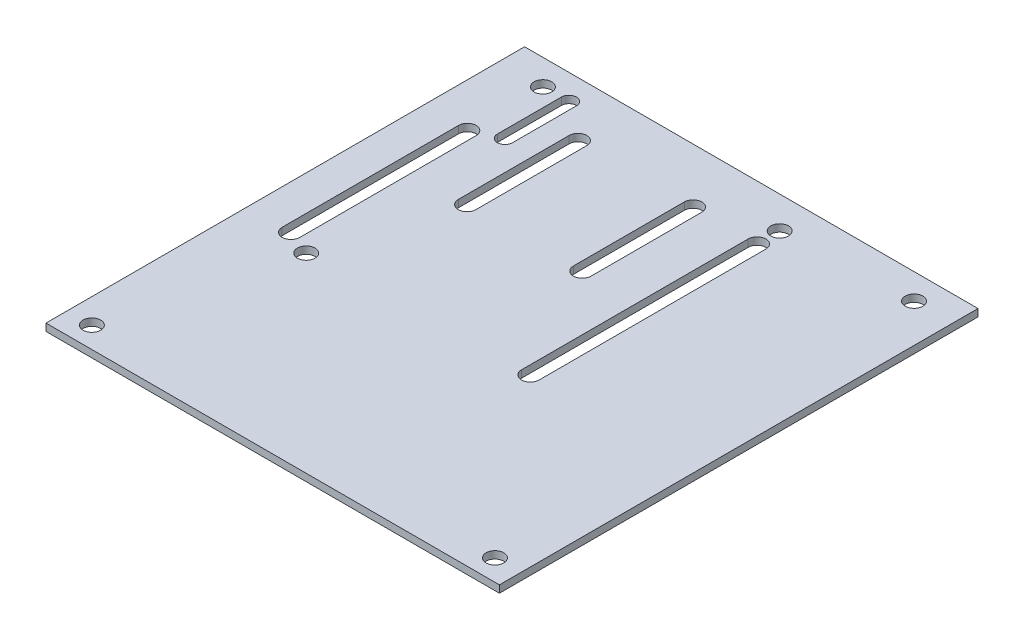
ISO-10303-21;
HEADER;
FILE_DESCRIPTION(('STEP AP214'),'2;1');
FILE_NAME('part.step','',(''),(''),'','','');
FILE_SCHEMA(('AUTOMOTIVE_DESIGN { 1 0 10303 214 1 1 1 1 }'));
ENDSEC;
DATA;
#1=APPLICATION_CONTEXT('core data for automotive mechanical design processes');
#2=APPLICATION_PROTOCOL_DEFINITION('international standard','automotive_design',2000,#1);
#3=PRODUCT_CONTEXT('',#1,'mechanical');
#4=PRODUCT('Part','Part','',(#3));
#5=PRODUCT_RELATED_PRODUCT_CATEGORY('part','',(#4));
#6=PRODUCT_DEFINITION_FORMATION('','',#4);
#7=PRODUCT_DEFINITION_CONTEXT('part definition',#1,'design');
#8=PRODUCT_DEFINITION('design','',#6,#7);
#9=PRODUCT_DEFINITION_SHAPE('','',#8);
#10=(LENGTH_UNIT() NAMED_UNIT(*) SI_UNIT(.MILLI.,.METRE.));
#11=(NAMED_UNIT(*) PLANE_ANGLE_UNIT() SI_UNIT($,.RADIAN.));
#12=(NAMED_UNIT(*) SI_UNIT($,.STERADIAN.) SOLID_ANGLE_UNIT());
#13=UNCERTAINTY_MEASURE_WITH_UNIT(LENGTH_MEASURE(1.E-05),#10,'distance_accuracy_value','');
#14=(GEOMETRIC_REPRESENTATION_CONTEXT(3) GLOBAL_UNCERTAINTY_ASSIGNED_CONTEXT((#13)) GLOBAL_UNIT_ASSIGNED_CONTEXT((#10,
#11,#12)) REPRESENTATION_CONTEXT('',''));
#15=CARTESIAN_POINT('',(0.,0.,0.));
#16=DIRECTION('',(0.,0.,1.));
#17=DIRECTION('',(1.,0.,0.));
#18=AXIS2_PLACEMENT_3D('',#15,#16,#17);
#19=CARTESIAN_POINT('',(0.,1.45,0.));
#20=DIRECTION('',(0.,1.,0.));
#21=DIRECTION('',(0.,0.,1.));
#22=AXIS2_PLACEMENT_3D('',#19,#20,#21);
#23=PLANE('',#22);
#24=CARTESIAN_POINT('',(39.92,1.45,43.305));
#25=DIRECTION('',(0.,-1.,0.));
#26=DIRECTION('',(0.,0.,-1.));
#27=AXIS2_PLACEMENT_3D('',#24,#25,#26);
#28=CIRCLE('',#27,1.75);
#29=CARTESIAN_POINT('',(39.92,1.45,41.555));
#30=VERTEX_POINT('',#29);
#31=EDGE_CURVE('E240',#30,#30,#28,.T.);
#32=ORIENTED_EDGE('',*,*,#31,.T.);
#33=EDGE_LOOP('',(#32));
#34=FACE_BOUND('',#33,.T.);
#35=CARTESIAN_POINT('',(-40.09,1.45,43.305));
#36=DIRECTION('',(0.,-1.,0.));
#37=DIRECTION('',(0.,0.,-1.));
#38=AXIS2_PLACEMENT_3D('',#35,#36,#37);
#39=CIRCLE('',#38,1.75);
#40=CARTESIAN_POINT('',(-40.09,1.45,41.555));
#41=VERTEX_POINT('',#40);
#42=EDGE_CURVE('E244',#41,#41,#39,.T.);
#43=ORIENTED_EDGE('',*,*,#42,.T.);
#44=EDGE_LOOP('',(#43));
#45=FACE_BOUND('',#44,.T.);
#46=CARTESIAN_POINT('',(37.38,1.45,-42.42));
#47=DIRECTION('',(0.,-1.,0.));
#48=DIRECTION('',(0.,0.,-1.));
#49=AXIS2_PLACEMENT_3D('',#46,#47,#48);
#50=CIRCLE('',#49,1.75);
#51=CARTESIAN_POINT('',(37.38,1.45,-44.17));
#52=VERTEX_POINT('',#51);
#53=EDGE_CURVE('E247',#52,#52,#50,.T.);
#54=ORIENTED_EDGE('',*,*,#53,.T.);
#55=EDGE_LOOP('',(#54));
#56=FACE_BOUND('',#55,.T.);
#57=CARTESIAN_POINT('',(-36.28,1.45,-42.42));
#58=DIRECTION('',(0.,-1.,0.));
#59=DIRECTION('',(0.,0.,-1.));
#60=AXIS2_PLACEMENT_3D('',#57,#58,#59);
#61=CIRCLE('',#60,1.75);
#62=CARTESIAN_POINT('',(-36.28,1.45,-44.17));
#63=VERTEX_POINT('',#62);
#64=EDGE_CURVE('E250',#63,#63,#61,.T.);
#65=ORIENTED_EDGE('',*,*,#64,.T.);
#66=EDGE_LOOP('',(#65));
#67=FACE_BOUND('',#66,.T.);
#68=CARTESIAN_POINT('',(-31.2,1.45,9.65));
#69=DIRECTION('',(0.,-1.,0.));
#70=DIRECTION('',(0.,0.,-1.));
#71=AXIS2_PLACEMENT_3D('',#68,#69,#70);
#72=CIRCLE('',#71,1.75);
#73=CARTESIAN_POINT('',(-31.2,1.45,7.9));
#74=VERTEX_POINT('',#73);
#75=EDGE_CURVE('E253',#74,#74,#72,.T.);
#76=ORIENTED_EDGE('',*,*,#75,.T.);
#77=EDGE_LOOP('',(#76));
#78=FACE_BOUND('',#77,.T.);
#79=CARTESIAN_POINT('',(11.98,1.45,-41.15));
#80=DIRECTION('',(0.,-1.,0.));
#81=DIRECTION('',(0.,0.,-1.));
#82=AXIS2_PLACEMENT_3D('',#79,#80,#81);
#83=CIRCLE('',#82,1.75);
#84=CARTESIAN_POINT('',(11.98,1.45,-42.9));
#85=VERTEX_POINT('',#84);
#86=EDGE_CURVE('E256',#85,#85,#83,.T.);
#87=ORIENTED_EDGE('',*,*,#86,.T.);
#88=EDGE_LOOP('',(#87));
#89=FACE_BOUND('',#88,.T.);
#90=DIRECTION('',(0.,0.,1.));
#91=VECTOR('',#90,1.);
#92=CARTESIAN_POINT('',(-32.7,1.45,-29.8));
#93=LINE('',#92,#91);
#94=CARTESIAN_POINT('',(-32.7,1.45,-29.8));
#95=VERTEX_POINT('',#94);
#96=CARTESIAN_POINT('',(-32.7,1.45,-42.5));
#97=VERTEX_POINT('',#96);
#98=EDGE_CURVE('E320',#95,#97,#93,.F.);
#99=ORIENTED_EDGE('',*,*,#98,.T.);
#100=CARTESIAN_POINT('',(-31.2,1.45,-42.5));
#101=DIRECTION('',(0.,-1.,0.));
#102=DIRECTION('',(0.,0.,-1.));
#103=AXIS2_PLACEMENT_3D('',#100,#101,#102);
#104=CIRCLE('',#103,1.5);
#105=CARTESIAN_POINT('',(-29.7,1.45,-42.5));
#106=VERTEX_POINT('',#105);
#107=EDGE_CURVE('E260',#97,#106,#104,.T.);
#108=ORIENTED_EDGE('',*,*,#107,.T.);
#109=DIRECTION('',(0.,0.,-1.));
#110=VECTOR('',#109,1.);
#111=CARTESIAN_POINT('',(-29.7,1.45,-42.5));
#112=LINE('',#111,#110);
#113=CARTESIAN_POINT('',(-29.7,1.45,-29.8));
#114=VERTEX_POINT('',#113);
#115=EDGE_CURVE('E317',#106,#114,#112,.F.);
#116=ORIENTED_EDGE('',*,*,#115,.T.);
#117=CARTESIAN_POINT('',(-31.2,1.45,-29.8));
#118=DIRECTION('',(0.,-1.,0.));
#119=DIRECTION('',(0.,0.,-1.));
#120=AXIS2_PLACEMENT_3D('',#117,#118,#119);
#121=CIRCLE('',#120,1.5);
#122=EDGE_CURVE('E263',#114,#95,#121,.T.);
#123=ORIENTED_EDGE('',*,*,#122,.T.);
#124=EDGE_LOOP('',(#99,#108,#116,#123));
#125=FACE_BOUND('',#124,.T.);
#126=DIRECTION('',(0.,0.,1.));
#127=VECTOR('',#126,1.);
#128=CARTESIAN_POINT('',(10.23,1.45,8.34999999999999));
#129=LINE('',#128,#127);
#130=CARTESIAN_POINT('',(10.23,1.45,8.34999999999999));
#131=VERTEX_POINT('',#130);
#132=CARTESIAN_POINT('',(10.23,1.45,-36.65));
#133=VERTEX_POINT('',#132);
#134=EDGE_CURVE('E325',#131,#133,#129,.F.);
#135=ORIENTED_EDGE('',*,*,#134,.T.);
#136=CARTESIAN_POINT('',(11.98,1.45,-36.65));
#137=DIRECTION('',(0.,-1.,0.));
#138=DIRECTION('',(0.,0.,-1.));
#139=AXIS2_PLACEMENT_3D('',#136,#137,#138);
#140=CIRCLE('',#139,1.75);
#141=CARTESIAN_POINT('',(13.73,1.45,-36.65));
#142=VERTEX_POINT('',#141);
#143=EDGE_CURVE('E267',#133,#142,#140,.T.);
#144=ORIENTED_EDGE('',*,*,#143,.T.);
#145=DIRECTION('',(0.,0.,-1.));
#146=VECTOR('',#145,1.);
#147=CARTESIAN_POINT('',(13.73,1.45,-36.65));
#148=LINE('',#147,#146);
#149=CARTESIAN_POINT('',(13.73,1.45,8.34999999999999));
#150=VERTEX_POINT('',#149);
#151=EDGE_CURVE('E322',#142,#150,#148,.F.);
#152=ORIENTED_EDGE('',*,*,#151,.T.);
#153=CARTESIAN_POINT('',(11.98,1.45,8.34999999999999));
#154=DIRECTION('',(0.,-1.,0.));
#155=DIRECTION('',(0.,0.,-1.));
#156=AXIS2_PLACEMENT_3D('',#153,#154,#155);
#157=CIRCLE('',#156,1.75);
#158=EDGE_CURVE('E271',#150,#131,#157,.T.);
#159=ORIENTED_EDGE('',*,*,#158,.T.);
#160=EDGE_LOOP('',(#135,#144,#152,#159));
#161=FACE_BOUND('',#160,.T.);
#162=DIRECTION('',(0.,0.,1.));
#163=VECTOR('',#162,1.);
#164=CARTESIAN_POINT('',(-38.03,1.45,7.57999999999999));
#165=LINE('',#164,#163);
#166=CARTESIAN_POINT('',(-38.03,1.45,7.57999999999999));
#167=VERTEX_POINT('',#166);
#168=CARTESIAN_POINT('',(-38.03,1.45,-27.42));
#169=VERTEX_POINT('',#168);
#170=EDGE_CURVE('E330',#167,#169,#165,.F.);
#171=ORIENTED_EDGE('',*,*,#170,.T.);
#172=CARTESIAN_POINT('',(-36.28,1.45,-27.42));
#173=DIRECTION('',(0.,-1.,0.));
#174=DIRECTION('',(0.,0.,-1.));
#175=AXIS2_PLACEMENT_3D('',#172,#173,#174);
#176=CIRCLE('',#175,1.75);
#177=CARTESIAN_POINT('',(-34.53,1.45,-27.42));
#178=VERTEX_POINT('',#177);
#179=EDGE_CURVE('E275',#169,#178,#176,.T.);
#180=ORIENTED_EDGE('',*,*,#179,.T.);
#181=DIRECTION('',(0.,0.,-1.));
#182=VECTOR('',#181,1.);
#183=CARTESIAN_POINT('',(-34.53,1.45,-27.42));
#184=LINE('',#183,#182);
#185=CARTESIAN_POINT('',(-34.53,1.45,7.57999999999999));
#186=VERTEX_POINT('',#185);
#187=EDGE_CURVE('E327',#178,#186,#184,.F.);
#188=ORIENTED_EDGE('',*,*,#187,.T.);
#189=CARTESIAN_POINT('',(-36.28,1.45,7.57999999999999));
#190=DIRECTION('',(0.,-1.,0.));
#191=DIRECTION('',(0.,0.,-1.));
#192=AXIS2_PLACEMENT_3D('',#189,#190,#191);
#193=CIRCLE('',#192,1.75);
#194=EDGE_CURVE('E279',#186,#167,#193,.T.);
#195=ORIENTED_EDGE('',*,*,#194,.T.);
#196=EDGE_LOOP('',(#171,#180,#188,#195));
#197=FACE_BOUND('',#196,.T.);
#198=DIRECTION('',(0.,0.,1.));
#199=VECTOR('',#198,1.);
#200=CARTESIAN_POINT('',(-2.47000000000001,1.45,-14.67));
#201=LINE('',#200,#199);
#202=CARTESIAN_POINT('',(-2.47000000000001,1.45,-14.67));
#203=VERTEX_POINT('',#202);
#204=CARTESIAN_POINT('',(-2.47000000000002,1.45,-36.67));
#205=VERTEX_POINT('',#204);
#206=EDGE_CURVE('E182',#203,#205,#201,.F.);
#207=ORIENTED_EDGE('',*,*,#206,.T.);
#208=CARTESIAN_POINT('',(-0.720000000000017,1.45,-36.67));
#209=DIRECTION('',(0.,-1.,0.));
#210=DIRECTION('',(0.,0.,-1.));
#211=AXIS2_PLACEMENT_3D('',#208,#209,#210);
#212=CIRCLE('',#211,1.75);
#213=CARTESIAN_POINT('',(1.02999999999999,1.45,-36.67));
#214=VERTEX_POINT('',#213);
#215=EDGE_CURVE('E283',#205,#214,#212,.T.);
#216=ORIENTED_EDGE('',*,*,#215,.T.);
#217=DIRECTION('',(0.,0.,-1.));
#218=VECTOR('',#217,1.);
#219=CARTESIAN_POINT('',(1.02999999999999,1.45,-36.67));
#220=LINE('',#219,#218);
#221=CARTESIAN_POINT('',(1.03,1.45,-14.67));
#222=VERTEX_POINT('',#221);
#223=EDGE_CURVE('E331',#214,#222,#220,.F.);
#224=ORIENTED_EDGE('',*,*,#223,.T.);
#225=CARTESIAN_POINT('',(-0.720000000000005,1.45,-14.67));
#226=DIRECTION('',(0.,-1.,0.));
#227=DIRECTION('',(0.,0.,-1.));
#228=AXIS2_PLACEMENT_3D('',#225,#226,#227);
#229=CIRCLE('',#228,1.75);
#230=EDGE_CURVE('E172',#222,#203,#229,.T.);
#231=ORIENTED_EDGE('',*,*,#230,.T.);
#232=EDGE_LOOP('',(#207,#216,#224,#231));
#233=FACE_BOUND('',#232,.T.);
#234=DIRECTION('',(0.,0.,1.));
#235=VECTOR('',#234,1.);
#236=CARTESIAN_POINT('',(-25.33,1.45,-14.67));
#237=LINE('',#236,#235);
#238=CARTESIAN_POINT('',(-25.33,1.45,-14.67));
#239=VERTEX_POINT('',#238);
#240=CARTESIAN_POINT('',(-25.33,1.45,-36.67));
#241=VERTEX_POINT('',#240);
#242=EDGE_CURVE('E184',#239,#241,#237,.F.);
#243=ORIENTED_EDGE('',*,*,#242,.T.);
#244=CARTESIAN_POINT('',(-23.58,1.45,-36.67));
#245=DIRECTION('',(0.,-1.,0.));
#246=DIRECTION('',(0.,0.,-1.));
#247=AXIS2_PLACEMENT_3D('',#244,#245,#246);
#248=CIRCLE('',#247,1.75);
#249=CARTESIAN_POINT('',(-21.83,1.45,-36.67));
#250=VERTEX_POINT('',#249);
#251=EDGE_CURVE('E176',#241,#250,#248,.T.);
#252=ORIENTED_EDGE('',*,*,#251,.T.);
#253=DIRECTION('',(0.,0.,-1.));
#254=VECTOR('',#253,1.);
#255=CARTESIAN_POINT('',(-21.83,1.45,-36.67));
#256=LINE('',#255,#254);
#257=CARTESIAN_POINT('',(-21.83,1.45,-14.67));
#258=VERTEX_POINT('',#257);
#259=EDGE_CURVE('E168',#250,#258,#256,.F.);
#260=ORIENTED_EDGE('',*,*,#259,.T.);
#261=CARTESIAN_POINT('',(-23.58,1.45,-14.67));
#262=DIRECTION('',(0.,-1.,0.));
#263=DIRECTION('',(0.,0.,-1.));
#264=AXIS2_PLACEMENT_3D('',#261,#262,#263);
#265=CIRCLE('',#264,1.75);
#266=EDGE_CURVE('E19',#258,#239,#265,.T.);
#267=ORIENTED_EDGE('',*,*,#266,.T.);
#268=EDGE_LOOP('',(#243,#252,#260,#267));
#269=FACE_BOUND('',#268,.T.);
#270=DIRECTION('',(0.,0.,1.));
#271=VECTOR('',#270,1.);
#272=CARTESIAN_POINT('',(-45.,1.45,-47.5));
#273=LINE('',#272,#271);
#274=CARTESIAN_POINT('',(-45.,1.45,47.5));
#275=VERTEX_POINT('',#274);
#276=CARTESIAN_POINT('',(-45.,1.45,-47.5));
#277=VERTEX_POINT('',#276);
#278=EDGE_CURVE('E311',#275,#277,#273,.F.);
#279=ORIENTED_EDGE('',*,*,#278,.F.);
#280=DIRECTION('',(1.,0.,0.));
#281=VECTOR('',#280,1.);
#282=CARTESIAN_POINT('',(-45.,1.45,47.5));
#283=LINE('',#282,#281);
#284=CARTESIAN_POINT('',(45.,1.45,47.5));
#285=VERTEX_POINT('',#284);
#286=EDGE_CURVE('E305',#285,#275,#283,.F.);
#287=ORIENTED_EDGE('',*,*,#286,.F.);
#288=DIRECTION('',(0.,0.,-1.));
#289=VECTOR('',#288,1.);
#290=CARTESIAN_POINT('',(45.,1.45,47.5));
#291=LINE('',#290,#289);
#292=CARTESIAN_POINT('',(45.,1.45,-47.5));
#293=VERTEX_POINT('',#292);
#294=EDGE_CURVE('E296',#293,#285,#291,.F.);
#295=ORIENTED_EDGE('',*,*,#294,.F.);
#296=DIRECTION('',(-1.,0.,0.));
#297=VECTOR('',#296,1.);
#298=CARTESIAN_POINT('',(45.,1.45,-47.5));
#299=LINE('',#298,#297);
#300=EDGE_CURVE('E314',#277,#293,#299,.F.);
#301=ORIENTED_EDGE('',*,*,#300,.F.);
#302=EDGE_LOOP('',(#279,#287,#295,#301));
#303=FACE_BOUND('',#302,.T.);
#304=ADVANCED_FACE('F16',(#34,#45,#56,#67,#78,#89,#125,#161,#197,#233,#269,#303),#23,.T.);
#305=CARTESIAN_POINT('',(45.,0.,-47.5));
#306=DIRECTION('',(0.,0.,-1.));
#307=DIRECTION('',(-1.,0.,0.));
#308=AXIS2_PLACEMENT_3D('',#305,#306,#307);
#309=PLANE('',#308);
#310=ORIENTED_EDGE('',*,*,#300,.T.);
#311=DIRECTION('',(0.,1.,0.));
#312=VECTOR('',#311,1.);
#313=CARTESIAN_POINT('',(45.,0.,-47.5));
#314=LINE('',#313,#312);
#315=CARTESIAN_POINT('',(45.,0.,-47.5));
#316=VERTEX_POINT('',#315);
#317=EDGE_CURVE('E299',#316,#293,#314,.T.);
#318=ORIENTED_EDGE('',*,*,#317,.F.);
#319=DIRECTION('',(1.,0.,0.));
#320=VECTOR('',#319,1.);
#321=CARTESIAN_POINT('',(0.,0.,-47.5));
#322=LINE('',#321,#320);
#323=CARTESIAN_POINT('',(-45.,0.,-47.5));
#324=VERTEX_POINT('',#323);
#325=EDGE_CURVE('E243',#316,#324,#322,.F.);
#326=ORIENTED_EDGE('',*,*,#325,.T.);
#327=DIRECTION('',(0.,1.,0.));
#328=VECTOR('',#327,1.);
#329=CARTESIAN_POINT('',(-45.,0.,-47.5));
#330=LINE('',#329,#328);
#331=EDGE_CURVE('E308',#277,#324,#330,.F.);
#332=ORIENTED_EDGE('',*,*,#331,.F.);
#333=EDGE_LOOP('',(#310,#318,#326,#332));
#334=FACE_BOUND('',#333,.T.);
#335=ADVANCED_FACE('F432',(#334),#309,.T.);
#336=CARTESIAN_POINT('',(-45.,0.,-47.5));
#337=DIRECTION('',(-1.,0.,0.));
#338=DIRECTION('',(0.,0.,1.));
#339=AXIS2_PLACEMENT_3D('',#336,#337,#338);
#340=PLANE('',#339);
#341=ORIENTED_EDGE('',*,*,#278,.T.);
#342=ORIENTED_EDGE('',*,*,#331,.T.);
#343=DIRECTION('',(0.,0.,1.));
#344=VECTOR('',#343,1.);
#345=CARTESIAN_POINT('',(-45.,0.,0.));
#346=LINE('',#345,#344);
#347=CARTESIAN_POINT('',(-45.,0.,47.5));
#348=VERTEX_POINT('',#347);
#349=EDGE_CURVE('E367',#324,#348,#346,.T.);
#350=ORIENTED_EDGE('',*,*,#349,.T.);
#351=DIRECTION('',(0.,1.,0.));
#352=VECTOR('',#351,1.);
#353=CARTESIAN_POINT('',(-45.,0.,47.5));
#354=LINE('',#353,#352);
#355=EDGE_CURVE('E302',#275,#348,#354,.F.);
#356=ORIENTED_EDGE('',*,*,#355,.F.);
#357=EDGE_LOOP('',(#341,#342,#350,#356));
#358=FACE_BOUND('',#357,.T.);
#359=ADVANCED_FACE('F704',(#358),#340,.T.);
#360=CARTESIAN_POINT('',(-45.,0.,47.5));
#361=DIRECTION('',(0.,0.,1.));
#362=DIRECTION('',(1.,0.,0.));
#363=AXIS2_PLACEMENT_3D('',#360,#361,#362);
#364=PLANE('',#363);
#365=ORIENTED_EDGE('',*,*,#286,.T.);
#366=ORIENTED_EDGE('',*,*,#355,.T.);
#367=DIRECTION('',(1.,0.,0.));
#368=VECTOR('',#367,1.);
#369=CARTESIAN_POINT('',(0.,0.,47.5));
#370=LINE('',#369,#368);
#371=CARTESIAN_POINT('',(45.,0.,47.5));
#372=VERTEX_POINT('',#371);
#373=EDGE_CURVE('E364',#348,#372,#370,.T.);
#374=ORIENTED_EDGE('',*,*,#373,.T.);
#375=DIRECTION('',(0.,1.,0.));
#376=VECTOR('',#375,1.);
#377=CARTESIAN_POINT('',(45.,0.,47.5));
#378=LINE('',#377,#376);
#379=EDGE_CURVE('E164',#285,#372,#378,.F.);
#380=ORIENTED_EDGE('',*,*,#379,.F.);
#381=EDGE_LOOP('',(#365,#366,#374,#380));
#382=FACE_BOUND('',#381,.T.);
#383=ADVANCED_FACE('F695',(#382),#364,.T.);
#384=CARTESIAN_POINT('',(45.,0.,47.5));
#385=DIRECTION('',(1.,0.,0.));
#386=DIRECTION('',(0.,0.,-1.));
#387=AXIS2_PLACEMENT_3D('',#384,#385,#386);
#388=PLANE('',#387);
#389=ORIENTED_EDGE('',*,*,#294,.T.);
#390=ORIENTED_EDGE('',*,*,#379,.T.);
#391=DIRECTION('',(0.,0.,1.));
#392=VECTOR('',#391,1.);
#393=CARTESIAN_POINT('',(45.,0.,0.));
#394=LINE('',#393,#392);
#395=EDGE_CURVE('E239',#372,#316,#394,.F.);
#396=ORIENTED_EDGE('',*,*,#395,.T.);
#397=ORIENTED_EDGE('',*,*,#317,.T.);
#398=EDGE_LOOP('',(#389,#390,#396,#397));
#399=FACE_BOUND('',#398,.T.);
#400=ADVANCED_FACE('F687',(#399),#388,.T.);
#401=CARTESIAN_POINT('',(-23.58,1.45,-14.67));
#402=DIRECTION('',(0.,-1.,0.));
#403=DIRECTION('',(0.,0.,-1.));
#404=AXIS2_PLACEMENT_3D('',#401,#402,#403);
#405=CYLINDRICAL_SURFACE('',#404,1.75);
#406=DIRECTION('',(0.,1.,0.));
#407=VECTOR('',#406,1.);
#408=CARTESIAN_POINT('',(-25.33,1.45,-14.67));
#409=LINE('',#408,#407);
#410=CARTESIAN_POINT('',(-25.33,0.,-14.67));
#411=VERTEX_POINT('',#410);
#412=EDGE_CURVE('E160',#411,#239,#409,.T.);
#413=ORIENTED_EDGE('',*,*,#412,.T.);
#414=ORIENTED_EDGE('',*,*,#266,.F.);
#415=DIRECTION('',(0.,1.,0.));
#416=VECTOR('',#415,1.);
#417=CARTESIAN_POINT('',(-21.83,1.45,-14.67));
#418=LINE('',#417,#416);
#419=CARTESIAN_POINT('',(-21.83,0.,-14.67));
#420=VERTEX_POINT('',#419);
#421=EDGE_CURVE('E158',#258,#420,#418,.F.);
#422=ORIENTED_EDGE('',*,*,#421,.T.);
#423=CARTESIAN_POINT('',(-23.58,0.,-14.67));
#424=DIRECTION('',(0.,-1.,0.));
#425=DIRECTION('',(0.,0.,-1.));
#426=AXIS2_PLACEMENT_3D('',#423,#424,#425);
#427=CIRCLE('',#426,1.75);
#428=EDGE_CURVE('E237',#420,#411,#427,.T.);
#429=ORIENTED_EDGE('',*,*,#428,.T.);
#430=EDGE_LOOP('',(#413,#414,#422,#429));
#431=FACE_BOUND('',#430,.T.);
#432=ADVANCED_FACE('F156',(#431),#405,.F.);
#433=CARTESIAN_POINT('',(-25.33,1.45,-14.67));
#434=DIRECTION('',(-1.,0.,0.));
#435=DIRECTION('',(0.,0.,1.));
#436=AXIS2_PLACEMENT_3D('',#433,#434,#435);
#437=PLANE('',#436);
#438=DIRECTION('',(0.,-1.,0.));
#439=VECTOR('',#438,1.);
#440=CARTESIAN_POINT('',(-25.33,1.45,-36.67));
#441=LINE('',#440,#439);
#442=CARTESIAN_POINT('',(-25.33,0.,-36.67));
#443=VERTEX_POINT('',#442);
#444=EDGE_CURVE('E185',#443,#241,#441,.F.);
#445=ORIENTED_EDGE('',*,*,#444,.T.);
#446=ORIENTED_EDGE('',*,*,#242,.F.);
#447=ORIENTED_EDGE('',*,*,#412,.F.);
#448=DIRECTION('',(0.,0.,1.));
#449=VECTOR('',#448,1.);
#450=CARTESIAN_POINT('',(-25.33,0.,0.));
#451=LINE('',#450,#449);
#452=EDGE_CURVE('E236',#411,#443,#451,.F.);
#453=ORIENTED_EDGE('',*,*,#452,.T.);
#454=EDGE_LOOP('',(#445,#446,#447,#453));
#455=FACE_BOUND('',#454,.T.);
#456=ADVANCED_FACE('F671',(#455),#437,.F.);
#457=CARTESIAN_POINT('',(-23.58,1.45,-36.67));
#458=DIRECTION('',(0.,-1.,0.));
#459=DIRECTION('',(0.,0.,-1.));
#460=AXIS2_PLACEMENT_3D('',#457,#458,#459);
#461=CYLINDRICAL_SURFACE('',#460,1.75);
#462=DIRECTION('',(0.,1.,0.));
#463=VECTOR('',#462,1.);
#464=CARTESIAN_POINT('',(-21.83,1.45,-36.67));
#465=LINE('',#464,#463);
#466=CARTESIAN_POINT('',(-21.83,0.,-36.67));
#467=VERTEX_POINT('',#466);
#468=EDGE_CURVE('E177',#467,#250,#465,.T.);
#469=ORIENTED_EDGE('',*,*,#468,.T.);
#470=ORIENTED_EDGE('',*,*,#251,.F.);
#471=ORIENTED_EDGE('',*,*,#444,.F.);
#472=CARTESIAN_POINT('',(-23.58,0.,-36.67));
#473=DIRECTION('',(0.,-1.,0.));
#474=DIRECTION('',(0.,0.,-1.));
#475=AXIS2_PLACEMENT_3D('',#472,#473,#474);
#476=CIRCLE('',#475,1.75);
#477=EDGE_CURVE('E233',#443,#467,#476,.T.);
#478=ORIENTED_EDGE('',*,*,#477,.T.);
#479=EDGE_LOOP('',(#469,#470,#471,#478));
#480=FACE_BOUND('',#479,.T.);
#481=ADVANCED_FACE('F663',(#480),#461,.F.);
#482=CARTESIAN_POINT('',(-21.83,1.45,-36.67));
#483=DIRECTION('',(1.,0.,0.));
#484=DIRECTION('',(0.,0.,-1.));
#485=AXIS2_PLACEMENT_3D('',#482,#483,#484);
#486=PLANE('',#485);
#487=ORIENTED_EDGE('',*,*,#421,.F.);
#488=ORIENTED_EDGE('',*,*,#259,.F.);
#489=ORIENTED_EDGE('',*,*,#468,.F.);
#490=DIRECTION('',(0.,0.,1.));
#491=VECTOR('',#490,1.);
#492=CARTESIAN_POINT('',(-21.83,0.,0.));
#493=LINE('',#492,#491);
#494=EDGE_CURVE('E171',#467,#420,#493,.T.);
#495=ORIENTED_EDGE('',*,*,#494,.T.);
#496=EDGE_LOOP('',(#487,#488,#489,#495));
#497=FACE_BOUND('',#496,.T.);
#498=ADVANCED_FACE('F167',(#497),#486,.F.);
#499=CARTESIAN_POINT('',(-0.720000000000005,1.45,-14.67));
#500=DIRECTION('',(0.,-1.,0.));
#501=DIRECTION('',(0.,0.,-1.));
#502=AXIS2_PLACEMENT_3D('',#499,#500,#501);
#503=CYLINDRICAL_SURFACE('',#502,1.75);
#504=DIRECTION('',(0.,1.,0.));
#505=VECTOR('',#504,1.);
#506=CARTESIAN_POINT('',(-2.47000000000001,1.45,-14.67));
#507=LINE('',#506,#505);
#508=CARTESIAN_POINT('',(-2.47000000000001,0.,-14.67));
#509=VERTEX_POINT('',#508);
#510=EDGE_CURVE('E287',#509,#203,#507,.T.);
#511=ORIENTED_EDGE('',*,*,#510,.T.);
#512=ORIENTED_EDGE('',*,*,#230,.F.);
#513=DIRECTION('',(0.,1.,0.));
#514=VECTOR('',#513,1.);
#515=CARTESIAN_POINT('',(1.03,1.45,-14.67));
#516=LINE('',#515,#514);
#517=CARTESIAN_POINT('',(1.02999999999999,0.,-14.67));
#518=VERTEX_POINT('',#517);
#519=EDGE_CURVE('E282',#222,#518,#516,.F.);
#520=ORIENTED_EDGE('',*,*,#519,.T.);
#521=CARTESIAN_POINT('',(-0.720000000000005,0.,-14.67));
#522=DIRECTION('',(0.,-1.,0.));
#523=DIRECTION('',(0.,0.,-1.));
#524=AXIS2_PLACEMENT_3D('',#521,#522,#523);
#525=CIRCLE('',#524,1.75);
#526=EDGE_CURVE('E230',#518,#509,#525,.T.);
#527=ORIENTED_EDGE('',*,*,#526,.T.);
#528=EDGE_LOOP('',(#511,#512,#520,#527));
#529=FACE_BOUND('',#528,.T.);
#530=ADVANCED_FACE('F648',(#529),#503,.F.);
#531=CARTESIAN_POINT('',(-2.47000000000001,1.45,-14.67));
#532=DIRECTION('',(-1.,0.,0.));
#533=DIRECTION('',(0.,0.,1.));
#534=AXIS2_PLACEMENT_3D('',#531,#532,#533);
#535=PLANE('',#534);
#536=DIRECTION('',(0.,-1.,0.));
#537=VECTOR('',#536,1.);
#538=CARTESIAN_POINT('',(-2.47000000000002,1.45,-36.67));
#539=LINE('',#538,#537);
#540=CARTESIAN_POINT('',(-2.47000000000001,0.,-36.67));
#541=VERTEX_POINT('',#540);
#542=EDGE_CURVE('E286',#541,#205,#539,.F.);
#543=ORIENTED_EDGE('',*,*,#542,.T.);
#544=ORIENTED_EDGE('',*,*,#206,.F.);
#545=ORIENTED_EDGE('',*,*,#510,.F.);
#546=DIRECTION('',(0.,0.,1.));
#547=VECTOR('',#546,1.);
#548=CARTESIAN_POINT('',(-2.47000000000001,0.,0.));
#549=LINE('',#548,#547);
#550=EDGE_CURVE('E229',#509,#541,#549,.F.);
#551=ORIENTED_EDGE('',*,*,#550,.T.);
#552=EDGE_LOOP('',(#543,#544,#545,#551));
#553=FACE_BOUND('',#552,.T.);
#554=ADVANCED_FACE('F353',(#553),#535,.F.);
#555=CARTESIAN_POINT('',(-0.720000000000017,1.45,-36.67));
#556=DIRECTION('',(0.,-1.,0.));
#557=DIRECTION('',(0.,0.,-1.));
#558=AXIS2_PLACEMENT_3D('',#555,#556,#557);
#559=CYLINDRICAL_SURFACE('',#558,1.75);
#560=DIRECTION('',(0.,1.,0.));
#561=VECTOR('',#560,1.);
#562=CARTESIAN_POINT('',(1.02999999999999,1.45,-36.67));
#563=LINE('',#562,#561);
#564=CARTESIAN_POINT('',(1.02999999999999,0.,-36.67));
#565=VERTEX_POINT('',#564);
#566=EDGE_CURVE('E285',#565,#214,#563,.T.);
#567=ORIENTED_EDGE('',*,*,#566,.T.);
#568=ORIENTED_EDGE('',*,*,#215,.F.);
#569=ORIENTED_EDGE('',*,*,#542,.F.);
#570=CARTESIAN_POINT('',(-0.720000000000017,0.,-36.67));
#571=DIRECTION('',(0.,-1.,0.));
#572=DIRECTION('',(0.,0.,-1.));
#573=AXIS2_PLACEMENT_3D('',#570,#571,#572);
#574=CIRCLE('',#573,1.75);
#575=EDGE_CURVE('E226',#541,#565,#574,.T.);
#576=ORIENTED_EDGE('',*,*,#575,.T.);
#577=EDGE_LOOP('',(#567,#568,#569,#576));
#578=FACE_BOUND('',#577,.T.);
#579=ADVANCED_FACE('F350',(#578),#559,.F.);
#580=CARTESIAN_POINT('',(1.02999999999999,1.45,-36.67));
#581=DIRECTION('',(1.,0.,0.));
#582=DIRECTION('',(0.,0.,-1.));
#583=AXIS2_PLACEMENT_3D('',#580,#581,#582);
#584=PLANE('',#583);
#585=ORIENTED_EDGE('',*,*,#519,.F.);
#586=ORIENTED_EDGE('',*,*,#223,.F.);
#587=ORIENTED_EDGE('',*,*,#566,.F.);
#588=DIRECTION('',(0.,0.,1.));
#589=VECTOR('',#588,1.);
#590=CARTESIAN_POINT('',(1.02999999999999,0.,0.));
#591=LINE('',#590,#589);
#592=EDGE_CURVE('E225',#565,#518,#591,.T.);
#593=ORIENTED_EDGE('',*,*,#592,.T.);
#594=EDGE_LOOP('',(#585,#586,#587,#593));
#595=FACE_BOUND('',#594,.T.);
#596=ADVANCED_FACE('F625',(#595),#584,.F.);
#597=CARTESIAN_POINT('',(-36.28,1.45,7.57999999999999));
#598=DIRECTION('',(0.,-1.,0.));
#599=DIRECTION('',(0.,0.,-1.));
#600=AXIS2_PLACEMENT_3D('',#597,#598,#599);
#601=CYLINDRICAL_SURFACE('',#600,1.75);
#602=DIRECTION('',(0.,1.,0.));
#603=VECTOR('',#602,1.);
#604=CARTESIAN_POINT('',(-38.03,1.45,7.57999999999999));
#605=LINE('',#604,#603);
#606=CARTESIAN_POINT('',(-38.03,0.,7.57999999999999));
#607=VERTEX_POINT('',#606);
#608=EDGE_CURVE('E281',#607,#167,#605,.T.);
#609=ORIENTED_EDGE('',*,*,#608,.T.);
#610=ORIENTED_EDGE('',*,*,#194,.F.);
#611=DIRECTION('',(0.,1.,0.));
#612=VECTOR('',#611,1.);
#613=CARTESIAN_POINT('',(-34.53,1.45,7.57999999999999));
#614=LINE('',#613,#612);
#615=CARTESIAN_POINT('',(-34.53,0.,7.57999999999999));
#616=VERTEX_POINT('',#615);
#617=EDGE_CURVE('E274',#186,#616,#614,.F.);
#618=ORIENTED_EDGE('',*,*,#617,.T.);
#619=CARTESIAN_POINT('',(-36.28,0.,7.57999999999999));
#620=DIRECTION('',(0.,-1.,0.));
#621=DIRECTION('',(0.,0.,-1.));
#622=AXIS2_PLACEMENT_3D('',#619,#620,#621);
#623=CIRCLE('',#622,1.75);
#624=EDGE_CURVE('E222',#616,#607,#623,.T.);
#625=ORIENTED_EDGE('',*,*,#624,.T.);
#626=EDGE_LOOP('',(#609,#610,#618,#625));
#627=FACE_BOUND('',#626,.T.);
#628=ADVANCED_FACE('F439',(#627),#601,.F.);
#629=CARTESIAN_POINT('',(-38.03,1.45,7.57999999999999));
#630=DIRECTION('',(-1.,0.,0.));
#631=DIRECTION('',(0.,0.,1.));
#632=AXIS2_PLACEMENT_3D('',#629,#630,#631);
#633=PLANE('',#632);
#634=DIRECTION('',(0.,-1.,0.));
#635=VECTOR('',#634,1.);
#636=CARTESIAN_POINT('',(-38.03,1.45,-27.42));
#637=LINE('',#636,#635);
#638=CARTESIAN_POINT('',(-38.03,0.,-27.42));
#639=VERTEX_POINT('',#638);
#640=EDGE_CURVE('E278',#639,#169,#637,.F.);
#641=ORIENTED_EDGE('',*,*,#640,.T.);
#642=ORIENTED_EDGE('',*,*,#170,.F.);
#643=ORIENTED_EDGE('',*,*,#608,.F.);
#644=DIRECTION('',(0.,0.,1.));
#645=VECTOR('',#644,1.);
#646=CARTESIAN_POINT('',(-38.03,0.,0.));
#647=LINE('',#646,#645);
#648=EDGE_CURVE('E221',#607,#639,#647,.F.);
#649=ORIENTED_EDGE('',*,*,#648,.T.);
#650=EDGE_LOOP('',(#641,#642,#643,#649));
#651=FACE_BOUND('',#650,.T.);
#652=ADVANCED_FACE('F394',(#651),#633,.F.);
#653=CARTESIAN_POINT('',(-36.28,1.45,-27.42));
#654=DIRECTION('',(0.,-1.,0.));
#655=DIRECTION('',(0.,0.,-1.));
#656=AXIS2_PLACEMENT_3D('',#653,#654,#655);
#657=CYLINDRICAL_SURFACE('',#656,1.75);
#658=DIRECTION('',(0.,1.,0.));
#659=VECTOR('',#658,1.);
#660=CARTESIAN_POINT('',(-34.53,1.45,-27.42));
#661=LINE('',#660,#659);
#662=CARTESIAN_POINT('',(-34.53,0.,-27.42));
#663=VERTEX_POINT('',#662);
#664=EDGE_CURVE('E277',#663,#178,#661,.T.);
#665=ORIENTED_EDGE('',*,*,#664,.T.);
#666=ORIENTED_EDGE('',*,*,#179,.F.);
#667=ORIENTED_EDGE('',*,*,#640,.F.);
#668=CARTESIAN_POINT('',(-36.28,0.,-27.42));
#669=DIRECTION('',(0.,-1.,0.));
#670=DIRECTION('',(0.,0.,-1.));
#671=AXIS2_PLACEMENT_3D('',#668,#669,#670);
#672=CIRCLE('',#671,1.75);
#673=EDGE_CURVE('E218',#639,#663,#672,.T.);
#674=ORIENTED_EDGE('',*,*,#673,.T.);
#675=EDGE_LOOP('',(#665,#666,#667,#674));
#676=FACE_BOUND('',#675,.T.);
#677=ADVANCED_FACE('F400',(#676),#657,.F.);
#678=CARTESIAN_POINT('',(-34.53,1.45,-27.42));
#679=DIRECTION('',(1.,0.,0.));
#680=DIRECTION('',(0.,0.,-1.));
#681=AXIS2_PLACEMENT_3D('',#678,#679,#680);
#682=PLANE('',#681);
#683=ORIENTED_EDGE('',*,*,#617,.F.);
#684=ORIENTED_EDGE('',*,*,#187,.F.);
#685=ORIENTED_EDGE('',*,*,#664,.F.);
#686=DIRECTION('',(0.,0.,1.));
#687=VECTOR('',#686,1.);
#688=CARTESIAN_POINT('',(-34.53,0.,0.));
#689=LINE('',#688,#687);
#690=EDGE_CURVE('E217',#663,#616,#689,.T.);
#691=ORIENTED_EDGE('',*,*,#690,.T.);
#692=EDGE_LOOP('',(#683,#684,#685,#691));
#693=FACE_BOUND('',#692,.T.);
#694=ADVANCED_FACE('F440',(#693),#682,.F.);
#695=CARTESIAN_POINT('',(11.98,1.45,8.34999999999999));
#696=DIRECTION('',(0.,-1.,0.));
#697=DIRECTION('',(0.,0.,-1.));
#698=AXIS2_PLACEMENT_3D('',#695,#696,#697);
#699=CYLINDRICAL_SURFACE('',#698,1.75);
#700=DIRECTION('',(0.,1.,0.));
#701=VECTOR('',#700,1.);
#702=CARTESIAN_POINT('',(10.23,1.45,8.34999999999999));
#703=LINE('',#702,#701);
#704=CARTESIAN_POINT('',(10.23,0.,8.34999999999999));
#705=VERTEX_POINT('',#704);
#706=EDGE_CURVE('E273',#705,#131,#703,.T.);
#707=ORIENTED_EDGE('',*,*,#706,.T.);
#708=ORIENTED_EDGE('',*,*,#158,.F.);
#709=DIRECTION('',(0.,1.,0.));
#710=VECTOR('',#709,1.);
#711=CARTESIAN_POINT('',(13.73,1.45,8.34999999999999));
#712=LINE('',#711,#710);
#713=CARTESIAN_POINT('',(13.73,0.,8.34999999999999));
#714=VERTEX_POINT('',#713);
#715=EDGE_CURVE('E266',#150,#714,#712,.F.);
#716=ORIENTED_EDGE('',*,*,#715,.T.);
#717=CARTESIAN_POINT('',(11.98,0.,8.34999999999999));
#718=DIRECTION('',(0.,-1.,0.));
#719=DIRECTION('',(0.,0.,-1.));
#720=AXIS2_PLACEMENT_3D('',#717,#718,#719);
#721=CIRCLE('',#720,1.75);
#722=EDGE_CURVE('E214',#714,#705,#721,.T.);
#723=ORIENTED_EDGE('',*,*,#722,.T.);
#724=EDGE_LOOP('',(#707,#708,#716,#723));
#725=FACE_BOUND('',#724,.T.);
#726=ADVANCED_FACE('F442',(#725),#699,.F.);
#727=CARTESIAN_POINT('',(10.23,1.45,8.34999999999999));
#728=DIRECTION('',(-1.,0.,0.));
#729=DIRECTION('',(0.,0.,1.));
#730=AXIS2_PLACEMENT_3D('',#727,#728,#729);
#731=PLANE('',#730);
#732=DIRECTION('',(0.,-1.,0.));
#733=VECTOR('',#732,1.);
#734=CARTESIAN_POINT('',(10.23,1.45,-36.65));
#735=LINE('',#734,#733);
#736=CARTESIAN_POINT('',(10.23,0.,-36.65));
#737=VERTEX_POINT('',#736);
#738=EDGE_CURVE('E270',#737,#133,#735,.F.);
#739=ORIENTED_EDGE('',*,*,#738,.T.);
#740=ORIENTED_EDGE('',*,*,#134,.F.);
#741=ORIENTED_EDGE('',*,*,#706,.F.);
#742=DIRECTION('',(0.,0.,1.));
#743=VECTOR('',#742,1.);
#744=CARTESIAN_POINT('',(10.23,0.,0.));
#745=LINE('',#744,#743);
#746=EDGE_CURVE('E213',#705,#737,#745,.F.);
#747=ORIENTED_EDGE('',*,*,#746,.T.);
#748=EDGE_LOOP('',(#739,#740,#741,#747));
#749=FACE_BOUND('',#748,.T.);
#750=ADVANCED_FACE('F449',(#749),#731,.F.);
#751=CARTESIAN_POINT('',(11.98,1.45,-36.65));
#752=DIRECTION('',(0.,-1.,0.));
#753=DIRECTION('',(0.,0.,-1.));
#754=AXIS2_PLACEMENT_3D('',#751,#752,#753);
#755=CYLINDRICAL_SURFACE('',#754,1.75);
#756=DIRECTION('',(0.,1.,0.));
#757=VECTOR('',#756,1.);
#758=CARTESIAN_POINT('',(13.73,1.45,-36.65));
#759=LINE('',#758,#757);
#760=CARTESIAN_POINT('',(13.73,0.,-36.65));
#761=VERTEX_POINT('',#760);
#762=EDGE_CURVE('E269',#761,#142,#759,.T.);
#763=ORIENTED_EDGE('',*,*,#762,.T.);
#764=ORIENTED_EDGE('',*,*,#143,.F.);
#765=ORIENTED_EDGE('',*,*,#738,.F.);
#766=CARTESIAN_POINT('',(11.98,0.,-36.65));
#767=DIRECTION('',(0.,-1.,0.));
#768=DIRECTION('',(0.,0.,-1.));
#769=AXIS2_PLACEMENT_3D('',#766,#767,#768);
#770=CIRCLE('',#769,1.75);
#771=EDGE_CURVE('E210',#737,#761,#770,.T.);
#772=ORIENTED_EDGE('',*,*,#771,.T.);
#773=EDGE_LOOP('',(#763,#764,#765,#772));
#774=FACE_BOUND('',#773,.T.);
#775=ADVANCED_FACE('F496',(#774),#755,.F.);
#776=CARTESIAN_POINT('',(13.73,1.45,-36.65));
#777=DIRECTION('',(1.,0.,0.));
#778=DIRECTION('',(0.,0.,-1.));
#779=AXIS2_PLACEMENT_3D('',#776,#777,#778);
#780=PLANE('',#779);
#781=ORIENTED_EDGE('',*,*,#715,.F.);
#782=ORIENTED_EDGE('',*,*,#151,.F.);
#783=ORIENTED_EDGE('',*,*,#762,.F.);
#784=DIRECTION('',(0.,0.,1.));
#785=VECTOR('',#784,1.);
#786=CARTESIAN_POINT('',(13.73,0.,0.));
#787=LINE('',#786,#785);
#788=EDGE_CURVE('E209',#761,#714,#787,.T.);
#789=ORIENTED_EDGE('',*,*,#788,.T.);
#790=EDGE_LOOP('',(#781,#782,#783,#789));
#791=FACE_BOUND('',#790,.T.);
#792=ADVANCED_FACE('F493',(#791),#780,.F.);
#793=CARTESIAN_POINT('',(-31.2,1.45,-29.8));
#794=DIRECTION('',(0.,-1.,0.));
#795=DIRECTION('',(0.,0.,-1.));
#796=AXIS2_PLACEMENT_3D('',#793,#794,#795);
#797=CYLINDRICAL_SURFACE('',#796,1.5);
#798=DIRECTION('',(0.,1.,0.));
#799=VECTOR('',#798,1.);
#800=CARTESIAN_POINT('',(-32.7,1.45,-29.8));
#801=LINE('',#800,#799);
#802=CARTESIAN_POINT('',(-32.7,0.,-29.8));
#803=VERTEX_POINT('',#802);
#804=EDGE_CURVE('E265',#803,#95,#801,.T.);
#805=ORIENTED_EDGE('',*,*,#804,.T.);
#806=ORIENTED_EDGE('',*,*,#122,.F.);
#807=DIRECTION('',(0.,1.,0.));
#808=VECTOR('',#807,1.);
#809=CARTESIAN_POINT('',(-29.7,1.45,-29.8));
#810=LINE('',#809,#808);
#811=CARTESIAN_POINT('',(-29.7,0.,-29.8));
#812=VERTEX_POINT('',#811);
#813=EDGE_CURVE('E259',#114,#812,#810,.F.);
#814=ORIENTED_EDGE('',*,*,#813,.T.);
#815=CARTESIAN_POINT('',(-31.2,0.,-29.8));
#816=DIRECTION('',(0.,-1.,0.));
#817=DIRECTION('',(0.,0.,-1.));
#818=AXIS2_PLACEMENT_3D('',#815,#816,#817);
#819=CIRCLE('',#818,1.5);
#820=EDGE_CURVE('E206',#812,#803,#819,.T.);
#821=ORIENTED_EDGE('',*,*,#820,.T.);
#822=EDGE_LOOP('',(#805,#806,#814,#821));
#823=FACE_BOUND('',#822,.T.);
#824=ADVANCED_FACE('F428',(#823),#797,.F.);
#825=CARTESIAN_POINT('',(-32.7,1.45,-29.8));
#826=DIRECTION('',(-1.,0.,0.));
#827=DIRECTION('',(0.,0.,1.));
#828=AXIS2_PLACEMENT_3D('',#825,#826,#827);
#829=PLANE('',#828);
#830=DIRECTION('',(0.,-1.,0.));
#831=VECTOR('',#830,1.);
#832=CARTESIAN_POINT('',(-32.7,1.45,-42.5));
#833=LINE('',#832,#831);
#834=CARTESIAN_POINT('',(-32.7,0.,-42.5));
#835=VERTEX_POINT('',#834);
#836=EDGE_CURVE('E262',#835,#97,#833,.F.);
#837=ORIENTED_EDGE('',*,*,#836,.T.);
#838=ORIENTED_EDGE('',*,*,#98,.F.);
#839=ORIENTED_EDGE('',*,*,#804,.F.);
#840=DIRECTION('',(0.,0.,1.));
#841=VECTOR('',#840,1.);
#842=CARTESIAN_POINT('',(-32.7,0.,0.));
#843=LINE('',#842,#841);
#844=EDGE_CURVE('E205',#803,#835,#843,.F.);
#845=ORIENTED_EDGE('',*,*,#844,.T.);
#846=EDGE_LOOP('',(#837,#838,#839,#845));
#847=FACE_BOUND('',#846,.T.);
#848=ADVANCED_FACE('F426',(#847),#829,.F.);
#849=CARTESIAN_POINT('',(-31.2,1.45,-42.5));
#850=DIRECTION('',(0.,-1.,0.));
#851=DIRECTION('',(0.,0.,-1.));
#852=AXIS2_PLACEMENT_3D('',#849,#850,#851);
#853=CYLINDRICAL_SURFACE('',#852,1.5);
#854=DIRECTION('',(0.,1.,0.));
#855=VECTOR('',#854,1.);
#856=CARTESIAN_POINT('',(-29.7,1.45,-42.5));
#857=LINE('',#856,#855);
#858=CARTESIAN_POINT('',(-29.7,0.,-42.5));
#859=VERTEX_POINT('',#858);
#860=EDGE_CURVE('E34',#859,#106,#857,.T.);
#861=ORIENTED_EDGE('',*,*,#860,.T.);
#862=ORIENTED_EDGE('',*,*,#107,.F.);
#863=ORIENTED_EDGE('',*,*,#836,.F.);
#864=CARTESIAN_POINT('',(-31.2,0.,-42.5));
#865=DIRECTION('',(0.,-1.,0.));
#866=DIRECTION('',(0.,0.,-1.));
#867=AXIS2_PLACEMENT_3D('',#864,#865,#866);
#868=CIRCLE('',#867,1.5);
#869=EDGE_CURVE('E202',#835,#859,#868,.T.);
#870=ORIENTED_EDGE('',*,*,#869,.T.);
#871=EDGE_LOOP('',(#861,#862,#863,#870));
#872=FACE_BOUND('',#871,.T.);
#873=ADVANCED_FACE('F422',(#872),#853,.F.);
#874=CARTESIAN_POINT('',(-29.7,1.45,-42.5));
#875=DIRECTION('',(1.,0.,0.));
#876=DIRECTION('',(0.,0.,-1.));
#877=AXIS2_PLACEMENT_3D('',#874,#875,#876);
#878=PLANE('',#877);
#879=ORIENTED_EDGE('',*,*,#813,.F.);
#880=ORIENTED_EDGE('',*,*,#115,.F.);
#881=ORIENTED_EDGE('',*,*,#860,.F.);
#882=DIRECTION('',(0.,0.,1.));
#883=VECTOR('',#882,1.);
#884=CARTESIAN_POINT('',(-29.7,0.,0.));
#885=LINE('',#884,#883);
#886=EDGE_CURVE('E201',#859,#812,#885,.T.);
#887=ORIENTED_EDGE('',*,*,#886,.T.);
#888=EDGE_LOOP('',(#879,#880,#881,#887));
#889=FACE_BOUND('',#888,.T.);
#890=ADVANCED_FACE('F416',(#889),#878,.F.);
#891=CARTESIAN_POINT('',(11.98,1.45,-41.15));
#892=DIRECTION('',(0.,-1.,0.));
#893=DIRECTION('',(0.,0.,-1.));
#894=AXIS2_PLACEMENT_3D('',#891,#892,#893);
#895=CYLINDRICAL_SURFACE('',#894,1.75);
#896=CARTESIAN_POINT('',(11.98,0.,-41.15));
#897=DIRECTION('',(0.,-1.,0.));
#898=DIRECTION('',(0.,0.,-1.));
#899=AXIS2_PLACEMENT_3D('',#896,#897,#898);
#900=CIRCLE('',#899,1.75);
#901=CARTESIAN_POINT('',(11.98,0.,-42.9));
#902=VERTEX_POINT('',#901);
#903=EDGE_CURVE('E198',#902,#902,#900,.T.);
#904=ORIENTED_EDGE('',*,*,#903,.T.);
#905=EDGE_LOOP('',(#904));
#906=FACE_BOUND('',#905,.T.);
#907=ORIENTED_EDGE('',*,*,#86,.F.);
#908=EDGE_LOOP('',(#907));
#909=FACE_BOUND('',#908,.T.);
#910=ADVANCED_FACE('F480',(#906,#909),#895,.F.);
#911=CARTESIAN_POINT('',(-31.2,1.45,9.65));
#912=DIRECTION('',(0.,-1.,0.));
#913=DIRECTION('',(0.,0.,-1.));
#914=AXIS2_PLACEMENT_3D('',#911,#912,#913);
#915=CYLINDRICAL_SURFACE('',#914,1.75);
#916=CARTESIAN_POINT('',(-31.2,0.,9.65));
#917=DIRECTION('',(0.,-1.,0.));
#918=DIRECTION('',(0.,0.,-1.));
#919=AXIS2_PLACEMENT_3D('',#916,#917,#918);
#920=CIRCLE('',#919,1.75);
#921=CARTESIAN_POINT('',(-31.2,0.,7.9));
#922=VERTEX_POINT('',#921);
#923=EDGE_CURVE('E195',#922,#922,#920,.T.);
#924=ORIENTED_EDGE('',*,*,#923,.T.);
#925=EDGE_LOOP('',(#924));
#926=FACE_BOUND('',#925,.T.);
#927=ORIENTED_EDGE('',*,*,#75,.F.);
#928=EDGE_LOOP('',(#927));
#929=FACE_BOUND('',#928,.T.);
#930=ADVANCED_FACE('F476',(#926,#929),#915,.F.);
#931=CARTESIAN_POINT('',(-36.28,1.45,-42.42));
#932=DIRECTION('',(0.,-1.,0.));
#933=DIRECTION('',(0.,0.,-1.));
#934=AXIS2_PLACEMENT_3D('',#931,#932,#933);
#935=CYLINDRICAL_SURFACE('',#934,1.75);
#936=CARTESIAN_POINT('',(-36.28,0.,-42.42));
#937=DIRECTION('',(0.,-1.,0.));
#938=DIRECTION('',(0.,0.,-1.));
#939=AXIS2_PLACEMENT_3D('',#936,#937,#938);
#940=CIRCLE('',#939,1.75);
#941=CARTESIAN_POINT('',(-36.28,0.,-44.17));
#942=VERTEX_POINT('',#941);
#943=EDGE_CURVE('E192',#942,#942,#940,.T.);
#944=ORIENTED_EDGE('',*,*,#943,.T.);
#945=EDGE_LOOP('',(#944));
#946=FACE_BOUND('',#945,.T.);
#947=ORIENTED_EDGE('',*,*,#64,.F.);
#948=EDGE_LOOP('',(#947));
#949=FACE_BOUND('',#948,.T.);
#950=ADVANCED_FACE('F472',(#946,#949),#935,.F.);
#951=CARTESIAN_POINT('',(37.38,1.45,-42.42));
#952=DIRECTION('',(0.,-1.,0.));
#953=DIRECTION('',(0.,0.,-1.));
#954=AXIS2_PLACEMENT_3D('',#951,#952,#953);
#955=CYLINDRICAL_SURFACE('',#954,1.75);
#956=CARTESIAN_POINT('',(37.38,0.,-42.42));
#957=DIRECTION('',(0.,-1.,0.));
#958=DIRECTION('',(0.,0.,-1.));
#959=AXIS2_PLACEMENT_3D('',#956,#957,#958);
#960=CIRCLE('',#959,1.75);
#961=CARTESIAN_POINT('',(37.38,0.,-44.17));
#962=VERTEX_POINT('',#961);
#963=EDGE_CURVE('E189',#962,#962,#960,.T.);
#964=ORIENTED_EDGE('',*,*,#963,.T.);
#965=EDGE_LOOP('',(#964));
#966=FACE_BOUND('',#965,.T.);
#967=ORIENTED_EDGE('',*,*,#53,.F.);
#968=EDGE_LOOP('',(#967));
#969=FACE_BOUND('',#968,.T.);
#970=ADVANCED_FACE('F468',(#966,#969),#955,.F.);
#971=CARTESIAN_POINT('',(-40.09,1.45,43.305));
#972=DIRECTION('',(0.,-1.,0.));
#973=DIRECTION('',(0.,0.,-1.));
#974=AXIS2_PLACEMENT_3D('',#971,#972,#973);
#975=CYLINDRICAL_SURFACE('',#974,1.75);
#976=CARTESIAN_POINT('',(-40.09,0.,43.305));
#977=DIRECTION('',(0.,-1.,0.));
#978=DIRECTION('',(0.,0.,-1.));
#979=AXIS2_PLACEMENT_3D('',#976,#977,#978);
#980=CIRCLE('',#979,1.75);
#981=CARTESIAN_POINT('',(-40.09,0.,41.555));
#982=VERTEX_POINT('',#981);
#983=EDGE_CURVE('E25',#982,#982,#980,.T.);
#984=ORIENTED_EDGE('',*,*,#983,.T.);
#985=EDGE_LOOP('',(#984));
#986=FACE_BOUND('',#985,.T.);
#987=ORIENTED_EDGE('',*,*,#42,.F.);
#988=EDGE_LOOP('',(#987));
#989=FACE_BOUND('',#988,.T.);
#990=ADVANCED_FACE('F460',(#986,#989),#975,.F.);
#991=CARTESIAN_POINT('',(39.92,1.45,43.305));
#992=DIRECTION('',(0.,-1.,0.));
#993=DIRECTION('',(0.,0.,-1.));
#994=AXIS2_PLACEMENT_3D('',#991,#992,#993);
#995=CYLINDRICAL_SURFACE('',#994,1.75);
#996=CARTESIAN_POINT('',(39.92,0.,43.305));
#997=DIRECTION('',(0.,-1.,0.));
#998=DIRECTION('',(0.,0.,-1.));
#999=AXIS2_PLACEMENT_3D('',#996,#997,#998);
#1000=CIRCLE('',#999,1.75);
#1001=CARTESIAN_POINT('',(39.92,0.,41.555));
#1002=VERTEX_POINT('',#1001);
#1003=EDGE_CURVE('E11',#1002,#1002,#1000,.T.);
#1004=ORIENTED_EDGE('',*,*,#1003,.T.);
#1005=EDGE_LOOP('',(#1004));
#1006=FACE_BOUND('',#1005,.T.);
#1007=ORIENTED_EDGE('',*,*,#31,.F.);
#1008=EDGE_LOOP('',(#1007));
#1009=FACE_BOUND('',#1008,.T.);
#1010=ADVANCED_FACE('F454',(#1006,#1009),#995,.F.);
#1011=CARTESIAN_POINT('',(0.,0.,0.));
#1012=DIRECTION('',(0.,1.,0.));
#1013=DIRECTION('',(0.,0.,1.));
#1014=AXIS2_PLACEMENT_3D('',#1011,#1012,#1013);
#1015=PLANE('',#1014);
#1016=ORIENTED_EDGE('',*,*,#1003,.F.);
#1017=EDGE_LOOP('',(#1016));
#1018=FACE_BOUND('',#1017,.T.);
#1019=ORIENTED_EDGE('',*,*,#983,.F.);
#1020=EDGE_LOOP('',(#1019));
#1021=FACE_BOUND('',#1020,.T.);
#1022=ORIENTED_EDGE('',*,*,#963,.F.);
#1023=EDGE_LOOP('',(#1022));
#1024=FACE_BOUND('',#1023,.T.);
#1025=ORIENTED_EDGE('',*,*,#943,.F.);
#1026=EDGE_LOOP('',(#1025));
#1027=FACE_BOUND('',#1026,.T.);
#1028=ORIENTED_EDGE('',*,*,#923,.F.);
#1029=EDGE_LOOP('',(#1028));
#1030=FACE_BOUND('',#1029,.T.);
#1031=ORIENTED_EDGE('',*,*,#903,.F.);
#1032=EDGE_LOOP('',(#1031));
#1033=FACE_BOUND('',#1032,.T.);
#1034=ORIENTED_EDGE('',*,*,#869,.F.);
#1035=ORIENTED_EDGE('',*,*,#844,.F.);
#1036=ORIENTED_EDGE('',*,*,#820,.F.);
#1037=ORIENTED_EDGE('',*,*,#886,.F.);
#1038=EDGE_LOOP('',(#1034,#1035,#1036,#1037));
#1039=FACE_BOUND('',#1038,.T.);
#1040=ORIENTED_EDGE('',*,*,#771,.F.);
#1041=ORIENTED_EDGE('',*,*,#746,.F.);
#1042=ORIENTED_EDGE('',*,*,#722,.F.);
#1043=ORIENTED_EDGE('',*,*,#788,.F.);
#1044=EDGE_LOOP('',(#1040,#1041,#1042,#1043));
#1045=FACE_BOUND('',#1044,.T.);
#1046=ORIENTED_EDGE('',*,*,#673,.F.);
#1047=ORIENTED_EDGE('',*,*,#648,.F.);
#1048=ORIENTED_EDGE('',*,*,#624,.F.);
#1049=ORIENTED_EDGE('',*,*,#690,.F.);
#1050=EDGE_LOOP('',(#1046,#1047,#1048,#1049));
#1051=FACE_BOUND('',#1050,.T.);
#1052=ORIENTED_EDGE('',*,*,#575,.F.);
#1053=ORIENTED_EDGE('',*,*,#550,.F.);
#1054=ORIENTED_EDGE('',*,*,#526,.F.);
#1055=ORIENTED_EDGE('',*,*,#592,.F.);
#1056=EDGE_LOOP('',(#1052,#1053,#1054,#1055));
#1057=FACE_BOUND('',#1056,.T.);
#1058=ORIENTED_EDGE('',*,*,#477,.F.);
#1059=ORIENTED_EDGE('',*,*,#452,.F.);
#1060=ORIENTED_EDGE('',*,*,#428,.F.);
#1061=ORIENTED_EDGE('',*,*,#494,.F.);
#1062=EDGE_LOOP('',(#1058,#1059,#1060,#1061));
#1063=FACE_BOUND('',#1062,.T.);
#1064=ORIENTED_EDGE('',*,*,#373,.F.);
#1065=ORIENTED_EDGE('',*,*,#349,.F.);
#1066=ORIENTED_EDGE('',*,*,#325,.F.);
#1067=ORIENTED_EDGE('',*,*,#395,.F.);
#1068=EDGE_LOOP('',(#1064,#1065,#1066,#1067));
#1069=FACE_BOUND('',#1068,.T.);
#1070=ADVANCED_FACE('F403',(#1018,#1021,#1024,#1027,#1030,#1033,#1039,#1045,#1051,#1057,#1063,
#1069),#1015,.F.);
#1071=CLOSED_SHELL('',(#304,#335,#359,#383,#400,#432,#456,#481,#498,#530,#554,#579,#596,#628,
#652,#677,#694,#726,#750,#775,#792,#824,#848,#873,#890,#910,#930,#950,#970,#990,#1010,#1070));
#1072=MANIFOLD_SOLID_BREP('B1',#1071);
#1073=ADVANCED_BREP_SHAPE_REPRESENTATION('',(#18,#1072),#14);
#1074=SHAPE_DEFINITION_REPRESENTATION(#9,#1073);
ENDSEC;
END-ISO-10303-21;
